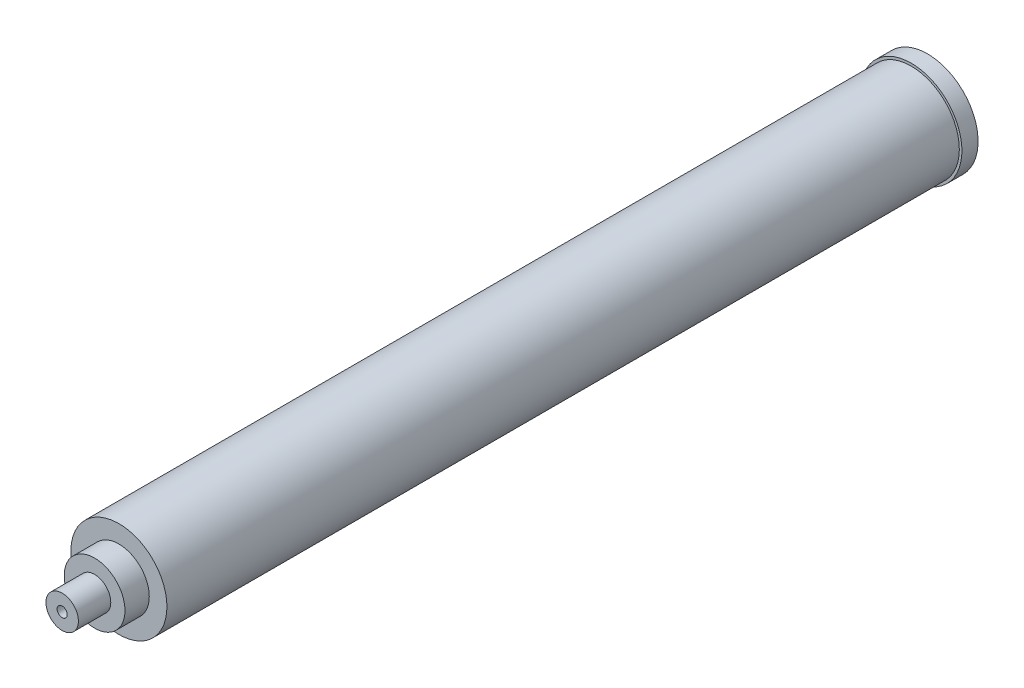
ISO-10303-21;
HEADER;
FILE_DESCRIPTION(('STEP AP214'),'2;1');
FILE_NAME('part.step','',(''),(''),'','','');
FILE_SCHEMA(('AUTOMOTIVE_DESIGN { 1 0 10303 214 1 1 1 1 }'));
ENDSEC;
DATA;
#1=APPLICATION_CONTEXT('core data for automotive mechanical design processes');
#2=APPLICATION_PROTOCOL_DEFINITION('international standard','automotive_design',2000,#1);
#3=PRODUCT_CONTEXT('',#1,'mechanical');
#4=PRODUCT('Part','Part','',(#3));
#5=PRODUCT_RELATED_PRODUCT_CATEGORY('part','',(#4));
#6=PRODUCT_DEFINITION_FORMATION('','',#4);
#7=PRODUCT_DEFINITION_CONTEXT('part definition',#1,'design');
#8=PRODUCT_DEFINITION('design','',#6,#7);
#9=PRODUCT_DEFINITION_SHAPE('','',#8);
#10=(LENGTH_UNIT() NAMED_UNIT(*) SI_UNIT(.MILLI.,.METRE.));
#11=(NAMED_UNIT(*) PLANE_ANGLE_UNIT() SI_UNIT($,.RADIAN.));
#12=(NAMED_UNIT(*) SI_UNIT($,.STERADIAN.) SOLID_ANGLE_UNIT());
#13=UNCERTAINTY_MEASURE_WITH_UNIT(LENGTH_MEASURE(1.E-05),#10,'distance_accuracy_value','');
#14=(GEOMETRIC_REPRESENTATION_CONTEXT(3) GLOBAL_UNCERTAINTY_ASSIGNED_CONTEXT((#13)) GLOBAL_UNIT_ASSIGNED_CONTEXT((#10,
#11,#12)) REPRESENTATION_CONTEXT('',''));
#15=CARTESIAN_POINT('',(0.,0.,0.));
#16=DIRECTION('',(0.,0.,1.));
#17=DIRECTION('',(1.,0.,0.));
#18=AXIS2_PLACEMENT_3D('',#15,#16,#17);
#19=CARTESIAN_POINT('',(0.,0.,621.03));
#20=DIRECTION('',(0.,0.,-1.));
#21=DIRECTION('',(-1.,0.,0.));
#22=AXIS2_PLACEMENT_3D('',#19,#20,#21);
#23=CYLINDRICAL_SURFACE('',#22,37.6555);
#24=CARTESIAN_POINT('',(0.,0.,621.03));
#25=DIRECTION('',(0.,0.,1.));
#26=DIRECTION('',(1.,0.,0.));
#27=AXIS2_PLACEMENT_3D('',#24,#25,#26);
#28=CIRCLE('',#27,37.6555);
#29=CARTESIAN_POINT('',(37.6555,0.,621.03));
#30=VERTEX_POINT('',#29);
#31=EDGE_CURVE('E76',#30,#30,#28,.T.);
#32=ORIENTED_EDGE('',*,*,#31,.F.);
#33=EDGE_LOOP('',(#32));
#34=FACE_BOUND('',#33,.T.);
#35=CARTESIAN_POINT('',(0.,0.,0.));
#36=DIRECTION('',(0.,0.,1.));
#37=DIRECTION('',(1.,0.,0.));
#38=AXIS2_PLACEMENT_3D('',#35,#36,#37);
#39=CIRCLE('',#38,37.6555);
#40=CARTESIAN_POINT('',(37.6555,0.,0.));
#41=VERTEX_POINT('',#40);
#42=EDGE_CURVE('E44',#41,#41,#39,.T.);
#43=ORIENTED_EDGE('',*,*,#42,.T.);
#44=EDGE_LOOP('',(#43));
#45=FACE_BOUND('',#44,.T.);
#46=ADVANCED_FACE('F41',(#34,#45),#23,.T.);
#47=CARTESIAN_POINT('',(0.,0.,621.03));
#48=DIRECTION('',(0.,0.,1.));
#49=DIRECTION('',(1.,0.,0.));
#50=AXIS2_PLACEMENT_3D('',#47,#48,#49);
#51=PLANE('',#50);
#52=CARTESIAN_POINT('',(0.,0.,621.03));
#53=DIRECTION('',(0.,0.,1.));
#54=DIRECTION('',(1.,0.,0.));
#55=AXIS2_PLACEMENT_3D('',#52,#53,#54);
#56=CIRCLE('',#55,23.8125);
#57=CARTESIAN_POINT('',(23.8125,0.,621.03));
#58=VERTEX_POINT('',#57);
#59=EDGE_CURVE('E48',#58,#58,#56,.T.);
#60=ORIENTED_EDGE('',*,*,#59,.F.);
#61=EDGE_LOOP('',(#60));
#62=FACE_BOUND('',#61,.T.);
#63=ORIENTED_EDGE('',*,*,#31,.T.);
#64=EDGE_LOOP('',(#63));
#65=FACE_BOUND('',#64,.T.);
#66=ADVANCED_FACE('F98',(#62,#65),#51,.T.);
#67=CARTESIAN_POINT('',(0.,0.,-12.7));
#68=DIRECTION('',(0.,0.,1.));
#69=DIRECTION('',(1.,0.,0.));
#70=AXIS2_PLACEMENT_3D('',#67,#68,#69);
#71=CYLINDRICAL_SURFACE('',#70,39.6621);
#72=CARTESIAN_POINT('',(0.,0.,-12.7));
#73=DIRECTION('',(0.,0.,-1.));
#74=DIRECTION('',(-1.,0.,0.));
#75=AXIS2_PLACEMENT_3D('',#72,#73,#74);
#76=CIRCLE('',#75,39.6621);
#77=CARTESIAN_POINT('',(-39.6621,0.,-12.7));
#78=VERTEX_POINT('',#77);
#79=EDGE_CURVE('E77',#78,#78,#76,.T.);
#80=ORIENTED_EDGE('',*,*,#79,.F.);
#81=EDGE_LOOP('',(#80));
#82=FACE_BOUND('',#81,.T.);
#83=CARTESIAN_POINT('',(0.,0.,0.));
#84=DIRECTION('',(0.,0.,-1.));
#85=DIRECTION('',(-1.,0.,0.));
#86=AXIS2_PLACEMENT_3D('',#83,#84,#85);
#87=CIRCLE('',#86,39.6621);
#88=CARTESIAN_POINT('',(-39.6621,0.,0.));
#89=VERTEX_POINT('',#88);
#90=EDGE_CURVE('E73',#89,#89,#87,.T.);
#91=ORIENTED_EDGE('',*,*,#90,.T.);
#92=EDGE_LOOP('',(#91));
#93=FACE_BOUND('',#92,.T.);
#94=ADVANCED_FACE('F96',(#82,#93),#71,.T.);
#95=CARTESIAN_POINT('',(0.,0.,-12.7));
#96=DIRECTION('',(0.,0.,-1.));
#97=DIRECTION('',(-1.,0.,0.));
#98=AXIS2_PLACEMENT_3D('',#95,#96,#97);
#99=PLANE('',#98);
#100=ORIENTED_EDGE('',*,*,#79,.T.);
#101=EDGE_LOOP('',(#100));
#102=FACE_BOUND('',#101,.T.);
#103=ADVANCED_FACE('F92',(#102),#99,.T.);
#104=CARTESIAN_POINT('',(0.,0.,0.));
#105=DIRECTION('',(0.,0.,-1.));
#106=DIRECTION('',(-1.,0.,0.));
#107=AXIS2_PLACEMENT_3D('',#104,#105,#106);
#108=PLANE('',#107);
#109=ORIENTED_EDGE('',*,*,#42,.F.);
#110=EDGE_LOOP('',(#109));
#111=FACE_BOUND('',#110,.T.);
#112=ORIENTED_EDGE('',*,*,#90,.F.);
#113=EDGE_LOOP('',(#112));
#114=FACE_BOUND('',#113,.T.);
#115=ADVANCED_FACE('F88',(#111,#114),#108,.F.);
#116=CARTESIAN_POINT('',(0.,0.,640.08));
#117=DIRECTION('',(0.,0.,-1.));
#118=DIRECTION('',(-1.,0.,0.));
#119=AXIS2_PLACEMENT_3D('',#116,#117,#118);
#120=CYLINDRICAL_SURFACE('',#119,23.8125);
#121=CARTESIAN_POINT('',(0.,0.,640.08));
#122=DIRECTION('',(0.,0.,1.));
#123=DIRECTION('',(1.,0.,0.));
#124=AXIS2_PLACEMENT_3D('',#121,#122,#123);
#125=CIRCLE('',#124,23.8125);
#126=CARTESIAN_POINT('',(23.8125,0.,640.08));
#127=VERTEX_POINT('',#126);
#128=EDGE_CURVE('E66',#127,#127,#125,.T.);
#129=ORIENTED_EDGE('',*,*,#128,.F.);
#130=EDGE_LOOP('',(#129));
#131=FACE_BOUND('',#130,.T.);
#132=ORIENTED_EDGE('',*,*,#59,.T.);
#133=EDGE_LOOP('',(#132));
#134=FACE_BOUND('',#133,.T.);
#135=ADVANCED_FACE('F91',(#131,#134),#120,.T.);
#136=CARTESIAN_POINT('',(0.,0.,640.08));
#137=DIRECTION('',(0.,0.,1.));
#138=DIRECTION('',(1.,0.,0.));
#139=AXIS2_PLACEMENT_3D('',#136,#137,#138);
#140=PLANE('',#139);
#141=CARTESIAN_POINT('',(0.,0.,640.08));
#142=DIRECTION('',(0.,0.,1.));
#143=DIRECTION('',(1.,0.,0.));
#144=AXIS2_PLACEMENT_3D('',#141,#142,#143);
#145=CIRCLE('',#144,12.7);
#146=CARTESIAN_POINT('',(12.7,0.,640.08));
#147=VERTEX_POINT('',#146);
#148=EDGE_CURVE('E11',#147,#147,#145,.T.);
#149=ORIENTED_EDGE('',*,*,#148,.F.);
#150=EDGE_LOOP('',(#149));
#151=FACE_BOUND('',#150,.T.);
#152=ORIENTED_EDGE('',*,*,#128,.T.);
#153=EDGE_LOOP('',(#152));
#154=FACE_BOUND('',#153,.T.);
#155=ADVANCED_FACE('F132',(#151,#154),#140,.T.);
#156=CARTESIAN_POINT('',(0.,0.,665.48));
#157=DIRECTION('',(0.,0.,-1.));
#158=DIRECTION('',(-1.,0.,0.));
#159=AXIS2_PLACEMENT_3D('',#156,#157,#158);
#160=CYLINDRICAL_SURFACE('',#159,12.7);
#161=CARTESIAN_POINT('',(0.,0.,665.48));
#162=DIRECTION('',(0.,0.,1.));
#163=DIRECTION('',(1.,0.,0.));
#164=AXIS2_PLACEMENT_3D('',#161,#162,#163);
#165=CIRCLE('',#164,12.7);
#166=CARTESIAN_POINT('',(12.7,0.,665.48));
#167=VERTEX_POINT('',#166);
#168=EDGE_CURVE('E62',#167,#167,#165,.T.);
#169=ORIENTED_EDGE('',*,*,#168,.F.);
#170=EDGE_LOOP('',(#169));
#171=FACE_BOUND('',#170,.T.);
#172=ORIENTED_EDGE('',*,*,#148,.T.);
#173=EDGE_LOOP('',(#172));
#174=FACE_BOUND('',#173,.T.);
#175=ADVANCED_FACE('F143',(#171,#174),#160,.T.);
#176=CARTESIAN_POINT('',(0.,0.,665.48));
#177=DIRECTION('',(0.,0.,1.));
#178=DIRECTION('',(1.,0.,0.));
#179=AXIS2_PLACEMENT_3D('',#176,#177,#178);
#180=PLANE('',#179);
#181=CARTESIAN_POINT('',(0.,0.,665.48));
#182=DIRECTION('',(0.,0.,1.));
#183=DIRECTION('',(1.,0.,0.));
#184=AXIS2_PLACEMENT_3D('',#181,#182,#183);
#185=CIRCLE('',#184,3.96874999999999);
#186=CARTESIAN_POINT('',(3.96874999999999,0.,665.48));
#187=VERTEX_POINT('',#186);
#188=EDGE_CURVE('E63',#187,#187,#185,.T.);
#189=ORIENTED_EDGE('',*,*,#188,.F.);
#190=EDGE_LOOP('',(#189));
#191=FACE_BOUND('',#190,.T.);
#192=ORIENTED_EDGE('',*,*,#168,.T.);
#193=EDGE_LOOP('',(#192));
#194=FACE_BOUND('',#193,.T.);
#195=ADVANCED_FACE('F56',(#191,#194),#180,.T.);
#196=CARTESIAN_POINT('',(0.,0.,640.08));
#197=DIRECTION('',(0.,0.,1.));
#198=DIRECTION('',(1.,0.,0.));
#199=AXIS2_PLACEMENT_3D('',#196,#197,#198);
#200=CONICAL_SURFACE('',#199,3.96874999999991,1.02974425867664);
#201=CARTESIAN_POINT('',(0.,0.,637.695334418234));
#202=VERTEX_POINT('',#201);
#203=VERTEX_LOOP('',#202);
#204=FACE_BOUND('',#203,.T.);
#205=CARTESIAN_POINT('',(0.,0.,640.08));
#206=DIRECTION('',(0.,0.,1.));
#207=DIRECTION('',(1.,0.,0.));
#208=AXIS2_PLACEMENT_3D('',#205,#206,#207);
#209=CIRCLE('',#208,3.96874999999991);
#210=CARTESIAN_POINT('',(3.96874999999991,0.,640.08));
#211=VERTEX_POINT('',#210);
#212=EDGE_CURVE('E60',#211,#211,#209,.T.);
#213=ORIENTED_EDGE('',*,*,#212,.T.);
#214=EDGE_LOOP('',(#213));
#215=FACE_BOUND('',#214,.T.);
#216=ADVANCED_FACE('F52',(#204,#215),#200,.F.);
#217=CARTESIAN_POINT('',(0.,0.,665.48));
#218=DIRECTION('',(0.,0.,1.));
#219=DIRECTION('',(1.,0.,0.));
#220=AXIS2_PLACEMENT_3D('',#217,#218,#219);
#221=CYLINDRICAL_SURFACE('',#220,3.96874999999995);
#222=ORIENTED_EDGE('',*,*,#212,.F.);
#223=EDGE_LOOP('',(#222));
#224=FACE_BOUND('',#223,.T.);
#225=ORIENTED_EDGE('',*,*,#188,.T.);
#226=EDGE_LOOP('',(#225));
#227=FACE_BOUND('',#226,.T.);
#228=ADVANCED_FACE('F55',(#224,#227),#221,.F.);
#229=CLOSED_SHELL('',(#46,#66,#94,#103,#115,#135,#155,#175,#195,#216,#228));
#230=MANIFOLD_SOLID_BREP('B2',#229);
#231=ADVANCED_BREP_SHAPE_REPRESENTATION('',(#18,#230),#14);
#232=SHAPE_DEFINITION_REPRESENTATION(#9,#231);
ENDSEC;
END-ISO-10303-21;
